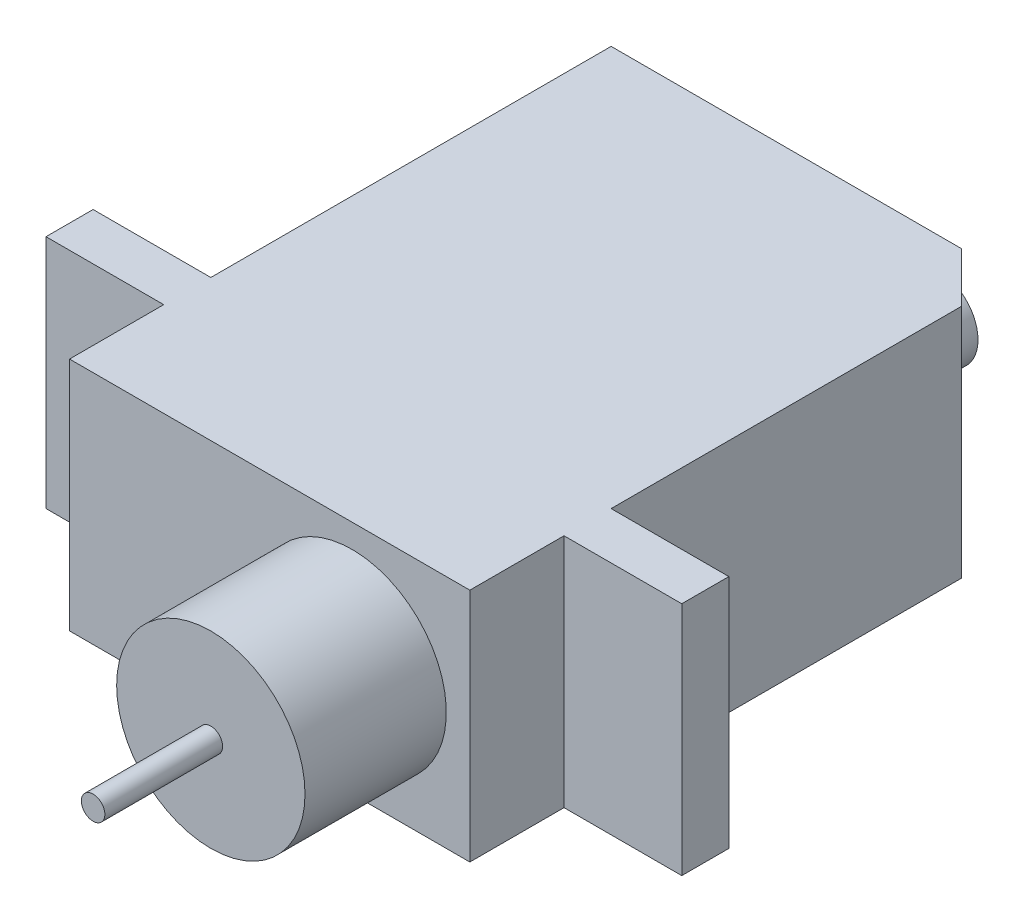
ISO-10303-21;
HEADER;
FILE_DESCRIPTION(('STEP AP214'),'2;1');
FILE_NAME('part.step','',(''),(''),'','','');
FILE_SCHEMA(('AUTOMOTIVE_DESIGN { 1 0 10303 214 1 1 1 1 }'));
ENDSEC;
DATA;
#1=APPLICATION_CONTEXT('core data for automotive mechanical design processes');
#2=APPLICATION_PROTOCOL_DEFINITION('international standard','automotive_design',2000,#1);
#3=PRODUCT_CONTEXT('',#1,'mechanical');
#4=PRODUCT('Part','Part','',(#3));
#5=PRODUCT_RELATED_PRODUCT_CATEGORY('part','',(#4));
#6=PRODUCT_DEFINITION_FORMATION('','',#4);
#7=PRODUCT_DEFINITION_CONTEXT('part definition',#1,'design');
#8=PRODUCT_DEFINITION('design','',#6,#7);
#9=PRODUCT_DEFINITION_SHAPE('','',#8);
#10=(LENGTH_UNIT() NAMED_UNIT(*) SI_UNIT(.MILLI.,.METRE.));
#11=(NAMED_UNIT(*) PLANE_ANGLE_UNIT() SI_UNIT($,.RADIAN.));
#12=(NAMED_UNIT(*) SI_UNIT($,.STERADIAN.) SOLID_ANGLE_UNIT());
#13=UNCERTAINTY_MEASURE_WITH_UNIT(LENGTH_MEASURE(1.E-05),#10,'distance_accuracy_value','');
#14=(GEOMETRIC_REPRESENTATION_CONTEXT(3) GLOBAL_UNCERTAINTY_ASSIGNED_CONTEXT((#13)) GLOBAL_UNIT_ASSIGNED_CONTEXT((#10,
#11,#12)) REPRESENTATION_CONTEXT('',''));
#15=CARTESIAN_POINT('',(0.,0.,0.));
#16=DIRECTION('',(0.,0.,1.));
#17=DIRECTION('',(1.,0.,0.));
#18=AXIS2_PLACEMENT_3D('',#15,#16,#17);
#19=CARTESIAN_POINT('',(0.,10.,17.));
#20=DIRECTION('',(1.,0.,0.));
#21=DIRECTION('',(0.,0.,-1.));
#22=AXIS2_PLACEMENT_3D('',#19,#20,#21);
#23=PLANE('',#22);
#24=DIRECTION('',(0.,0.,1.));
#25=VECTOR('',#24,1.);
#26=CARTESIAN_POINT('',(0.,0.,17.));
#27=LINE('',#26,#25);
#28=CARTESIAN_POINT('',(0.,0.,0.));
#29=VERTEX_POINT('',#28);
#30=CARTESIAN_POINT('',(0.,0.,17.));
#31=VERTEX_POINT('',#30);
#32=EDGE_CURVE('E163',#29,#31,#27,.T.);
#33=ORIENTED_EDGE('',*,*,#32,.T.);
#34=DIRECTION('',(0.,-1.,0.));
#35=VECTOR('',#34,1.);
#36=CARTESIAN_POINT('',(0.,10.,17.));
#37=LINE('',#36,#35);
#38=CARTESIAN_POINT('',(0.,10.,17.));
#39=VERTEX_POINT('',#38);
#40=EDGE_CURVE('E216',#39,#31,#37,.T.);
#41=ORIENTED_EDGE('',*,*,#40,.F.);
#42=DIRECTION('',(0.,0.,1.));
#43=VECTOR('',#42,1.);
#44=CARTESIAN_POINT('',(0.,10.,17.));
#45=LINE('',#44,#43);
#46=CARTESIAN_POINT('',(0.,10.,0.));
#47=VERTEX_POINT('',#46);
#48=EDGE_CURVE('E188',#47,#39,#45,.T.);
#49=ORIENTED_EDGE('',*,*,#48,.F.);
#50=DIRECTION('',(0.,-1.,0.));
#51=VECTOR('',#50,1.);
#52=CARTESIAN_POINT('',(0.,10.,0.));
#53=LINE('',#52,#51);
#54=EDGE_CURVE('E159',#47,#29,#53,.T.);
#55=ORIENTED_EDGE('',*,*,#54,.T.);
#56=EDGE_LOOP('',(#33,#41,#49,#55));
#57=FACE_BOUND('',#56,.T.);
#58=ADVANCED_FACE('F36',(#57),#23,.F.);
#59=CARTESIAN_POINT('',(-5.,10.,17.));
#60=DIRECTION('',(0.,0.,1.));
#61=DIRECTION('',(1.,0.,0.));
#62=AXIS2_PLACEMENT_3D('',#59,#60,#61);
#63=PLANE('',#62);
#64=DIRECTION('',(-1.,0.,0.));
#65=VECTOR('',#64,1.);
#66=CARTESIAN_POINT('',(-5.,0.,17.));
#67=LINE('',#66,#65);
#68=CARTESIAN_POINT('',(-5.,0.,17.));
#69=VERTEX_POINT('',#68);
#70=EDGE_CURVE('E166',#31,#69,#67,.T.);
#71=ORIENTED_EDGE('',*,*,#70,.T.);
#72=DIRECTION('',(0.,-1.,0.));
#73=VECTOR('',#72,1.);
#74=CARTESIAN_POINT('',(-5.,10.,17.));
#75=LINE('',#74,#73);
#76=CARTESIAN_POINT('',(-5.,10.,17.));
#77=VERTEX_POINT('',#76);
#78=EDGE_CURVE('E213',#77,#69,#75,.T.);
#79=ORIENTED_EDGE('',*,*,#78,.F.);
#80=DIRECTION('',(-1.,0.,0.));
#81=VECTOR('',#80,1.);
#82=CARTESIAN_POINT('',(-5.,10.,17.));
#83=LINE('',#82,#81);
#84=EDGE_CURVE('E111',#39,#77,#83,.T.);
#85=ORIENTED_EDGE('',*,*,#84,.F.);
#86=ORIENTED_EDGE('',*,*,#40,.T.);
#87=EDGE_LOOP('',(#71,#79,#85,#86));
#88=FACE_BOUND('',#87,.T.);
#89=ADVANCED_FACE('F302',(#88),#63,.F.);
#90=CARTESIAN_POINT('',(-5.,10.,19.));
#91=DIRECTION('',(1.,0.,0.));
#92=DIRECTION('',(0.,0.,-1.));
#93=AXIS2_PLACEMENT_3D('',#90,#91,#92);
#94=PLANE('',#93);
#95=DIRECTION('',(0.,0.,1.));
#96=VECTOR('',#95,1.);
#97=CARTESIAN_POINT('',(-5.,0.,19.));
#98=LINE('',#97,#96);
#99=CARTESIAN_POINT('',(-5.,0.,19.));
#100=VERTEX_POINT('',#99);
#101=EDGE_CURVE('E169',#69,#100,#98,.T.);
#102=ORIENTED_EDGE('',*,*,#101,.T.);
#103=DIRECTION('',(0.,-1.,0.));
#104=VECTOR('',#103,1.);
#105=CARTESIAN_POINT('',(-5.,10.,19.));
#106=LINE('',#105,#104);
#107=CARTESIAN_POINT('',(-5.,10.,19.));
#108=VERTEX_POINT('',#107);
#109=EDGE_CURVE('E210',#108,#100,#106,.T.);
#110=ORIENTED_EDGE('',*,*,#109,.F.);
#111=DIRECTION('',(0.,0.,1.));
#112=VECTOR('',#111,1.);
#113=CARTESIAN_POINT('',(-5.,10.,19.));
#114=LINE('',#113,#112);
#115=EDGE_CURVE('E264',#77,#108,#114,.T.);
#116=ORIENTED_EDGE('',*,*,#115,.F.);
#117=ORIENTED_EDGE('',*,*,#78,.T.);
#118=EDGE_LOOP('',(#102,#110,#116,#117));
#119=FACE_BOUND('',#118,.T.);
#120=ADVANCED_FACE('F307',(#119),#94,.F.);
#121=CARTESIAN_POINT('',(0.,10.,19.));
#122=DIRECTION('',(0.,0.,-1.));
#123=DIRECTION('',(-1.,0.,0.));
#124=AXIS2_PLACEMENT_3D('',#121,#122,#123);
#125=PLANE('',#124);
#126=DIRECTION('',(1.,0.,0.));
#127=VECTOR('',#126,1.);
#128=CARTESIAN_POINT('',(0.,0.,19.));
#129=LINE('',#128,#127);
#130=CARTESIAN_POINT('',(0.,0.,19.));
#131=VERTEX_POINT('',#130);
#132=EDGE_CURVE('E171',#100,#131,#129,.T.);
#133=ORIENTED_EDGE('',*,*,#132,.T.);
#134=DIRECTION('',(0.,-1.,0.));
#135=VECTOR('',#134,1.);
#136=CARTESIAN_POINT('',(0.,10.,19.));
#137=LINE('',#136,#135);
#138=CARTESIAN_POINT('',(0.,10.,19.));
#139=VERTEX_POINT('',#138);
#140=EDGE_CURVE('E207',#139,#131,#137,.T.);
#141=ORIENTED_EDGE('',*,*,#140,.F.);
#142=DIRECTION('',(1.,0.,0.));
#143=VECTOR('',#142,1.);
#144=CARTESIAN_POINT('',(0.,10.,19.));
#145=LINE('',#144,#143);
#146=EDGE_CURVE('E262',#108,#139,#145,.T.);
#147=ORIENTED_EDGE('',*,*,#146,.F.);
#148=ORIENTED_EDGE('',*,*,#109,.T.);
#149=EDGE_LOOP('',(#133,#141,#147,#148));
#150=FACE_BOUND('',#149,.T.);
#151=ADVANCED_FACE('F319',(#150),#125,.F.);
#152=CARTESIAN_POINT('',(0.,10.,23.));
#153=DIRECTION('',(1.,0.,0.));
#154=DIRECTION('',(0.,0.,-1.));
#155=AXIS2_PLACEMENT_3D('',#152,#153,#154);
#156=PLANE('',#155);
#157=DIRECTION('',(0.,0.,1.));
#158=VECTOR('',#157,1.);
#159=CARTESIAN_POINT('',(0.,0.,23.));
#160=LINE('',#159,#158);
#161=CARTESIAN_POINT('',(0.,0.,23.));
#162=VERTEX_POINT('',#161);
#163=EDGE_CURVE('E173',#131,#162,#160,.T.);
#164=ORIENTED_EDGE('',*,*,#163,.T.);
#165=DIRECTION('',(0.,-1.,0.));
#166=VECTOR('',#165,1.);
#167=CARTESIAN_POINT('',(0.,10.,23.));
#168=LINE('',#167,#166);
#169=CARTESIAN_POINT('',(0.,10.,23.));
#170=VERTEX_POINT('',#169);
#171=EDGE_CURVE('E204',#170,#162,#168,.T.);
#172=ORIENTED_EDGE('',*,*,#171,.F.);
#173=DIRECTION('',(0.,0.,1.));
#174=VECTOR('',#173,1.);
#175=CARTESIAN_POINT('',(0.,10.,23.));
#176=LINE('',#175,#174);
#177=EDGE_CURVE('E260',#139,#170,#176,.T.);
#178=ORIENTED_EDGE('',*,*,#177,.F.);
#179=ORIENTED_EDGE('',*,*,#140,.T.);
#180=EDGE_LOOP('',(#164,#172,#178,#179));
#181=FACE_BOUND('',#180,.T.);
#182=ADVANCED_FACE('F226',(#181),#156,.F.);
#183=CARTESIAN_POINT('',(17.,10.,23.));
#184=DIRECTION('',(0.,0.,-1.));
#185=DIRECTION('',(-1.,0.,0.));
#186=AXIS2_PLACEMENT_3D('',#183,#184,#185);
#187=PLANE('',#186);
#188=CARTESIAN_POINT('',(12.,5.,23.));
#189=DIRECTION('',(0.,0.,-1.));
#190=DIRECTION('',(-1.,0.,0.));
#191=AXIS2_PLACEMENT_3D('',#188,#189,#190);
#192=CIRCLE('',#191,4.);
#193=CARTESIAN_POINT('',(8.00000000000001,5.,23.));
#194=VERTEX_POINT('',#193);
#195=EDGE_CURVE('E44',#194,#194,#192,.F.);
#196=ORIENTED_EDGE('',*,*,#195,.F.);
#197=EDGE_LOOP('',(#196));
#198=FACE_BOUND('',#197,.T.);
#199=DIRECTION('',(1.,0.,0.));
#200=VECTOR('',#199,1.);
#201=CARTESIAN_POINT('',(17.,0.,23.));
#202=LINE('',#201,#200);
#203=CARTESIAN_POINT('',(17.,0.,23.));
#204=VERTEX_POINT('',#203);
#205=EDGE_CURVE('E175',#162,#204,#202,.T.);
#206=ORIENTED_EDGE('',*,*,#205,.T.);
#207=DIRECTION('',(0.,-1.,0.));
#208=VECTOR('',#207,1.);
#209=CARTESIAN_POINT('',(17.,10.,23.));
#210=LINE('',#209,#208);
#211=CARTESIAN_POINT('',(17.,10.,23.));
#212=VERTEX_POINT('',#211);
#213=EDGE_CURVE('E201',#212,#204,#210,.T.);
#214=ORIENTED_EDGE('',*,*,#213,.F.);
#215=DIRECTION('',(1.,0.,0.));
#216=VECTOR('',#215,1.);
#217=CARTESIAN_POINT('',(17.,10.,23.));
#218=LINE('',#217,#216);
#219=EDGE_CURVE('E258',#170,#212,#218,.T.);
#220=ORIENTED_EDGE('',*,*,#219,.F.);
#221=ORIENTED_EDGE('',*,*,#171,.T.);
#222=EDGE_LOOP('',(#206,#214,#220,#221));
#223=FACE_BOUND('',#222,.T.);
#224=ADVANCED_FACE('F222',(#198,#223),#187,.F.);
#225=CARTESIAN_POINT('',(17.,10.,19.));
#226=DIRECTION('',(-1.,0.,0.));
#227=DIRECTION('',(0.,0.,1.));
#228=AXIS2_PLACEMENT_3D('',#225,#226,#227);
#229=PLANE('',#228);
#230=DIRECTION('',(0.,0.,-1.));
#231=VECTOR('',#230,1.);
#232=CARTESIAN_POINT('',(17.,0.,19.));
#233=LINE('',#232,#231);
#234=CARTESIAN_POINT('',(17.,0.,19.));
#235=VERTEX_POINT('',#234);
#236=EDGE_CURVE('E177',#204,#235,#233,.T.);
#237=ORIENTED_EDGE('',*,*,#236,.T.);
#238=DIRECTION('',(0.,-1.,0.));
#239=VECTOR('',#238,1.);
#240=CARTESIAN_POINT('',(17.,10.,19.));
#241=LINE('',#240,#239);
#242=CARTESIAN_POINT('',(17.,10.,19.));
#243=VERTEX_POINT('',#242);
#244=EDGE_CURVE('E198',#243,#235,#241,.T.);
#245=ORIENTED_EDGE('',*,*,#244,.F.);
#246=DIRECTION('',(0.,0.,-1.));
#247=VECTOR('',#246,1.);
#248=CARTESIAN_POINT('',(17.,10.,19.));
#249=LINE('',#248,#247);
#250=EDGE_CURVE('E238',#212,#243,#249,.T.);
#251=ORIENTED_EDGE('',*,*,#250,.F.);
#252=ORIENTED_EDGE('',*,*,#213,.T.);
#253=EDGE_LOOP('',(#237,#245,#251,#252));
#254=FACE_BOUND('',#253,.T.);
#255=ADVANCED_FACE('F225',(#254),#229,.F.);
#256=CARTESIAN_POINT('',(22.,10.,19.));
#257=DIRECTION('',(0.,0.,-1.));
#258=DIRECTION('',(-1.,0.,0.));
#259=AXIS2_PLACEMENT_3D('',#256,#257,#258);
#260=PLANE('',#259);
#261=DIRECTION('',(1.,0.,0.));
#262=VECTOR('',#261,1.);
#263=CARTESIAN_POINT('',(22.,0.,19.));
#264=LINE('',#263,#262);
#265=CARTESIAN_POINT('',(22.,0.,19.));
#266=VERTEX_POINT('',#265);
#267=EDGE_CURVE('E179',#235,#266,#264,.T.);
#268=ORIENTED_EDGE('',*,*,#267,.T.);
#269=DIRECTION('',(0.,-1.,0.));
#270=VECTOR('',#269,1.);
#271=CARTESIAN_POINT('',(22.,10.,19.));
#272=LINE('',#271,#270);
#273=CARTESIAN_POINT('',(22.,10.,19.));
#274=VERTEX_POINT('',#273);
#275=EDGE_CURVE('E195',#274,#266,#272,.T.);
#276=ORIENTED_EDGE('',*,*,#275,.F.);
#277=DIRECTION('',(1.,0.,0.));
#278=VECTOR('',#277,1.);
#279=CARTESIAN_POINT('',(22.,10.,19.));
#280=LINE('',#279,#278);
#281=EDGE_CURVE('E253',#243,#274,#280,.T.);
#282=ORIENTED_EDGE('',*,*,#281,.F.);
#283=ORIENTED_EDGE('',*,*,#244,.T.);
#284=EDGE_LOOP('',(#268,#276,#282,#283));
#285=FACE_BOUND('',#284,.T.);
#286=ADVANCED_FACE('F246',(#285),#260,.F.);
#287=CARTESIAN_POINT('',(22.,10.,17.));
#288=DIRECTION('',(-1.,0.,0.));
#289=DIRECTION('',(0.,0.,1.));
#290=AXIS2_PLACEMENT_3D('',#287,#288,#289);
#291=PLANE('',#290);
#292=DIRECTION('',(0.,0.,-1.));
#293=VECTOR('',#292,1.);
#294=CARTESIAN_POINT('',(22.,0.,17.));
#295=LINE('',#294,#293);
#296=CARTESIAN_POINT('',(22.,0.,17.));
#297=VERTEX_POINT('',#296);
#298=EDGE_CURVE('E181',#266,#297,#295,.T.);
#299=ORIENTED_EDGE('',*,*,#298,.T.);
#300=DIRECTION('',(0.,-1.,0.));
#301=VECTOR('',#300,1.);
#302=CARTESIAN_POINT('',(22.,10.,17.));
#303=LINE('',#302,#301);
#304=CARTESIAN_POINT('',(22.,10.,17.));
#305=VERTEX_POINT('',#304);
#306=EDGE_CURVE('E192',#305,#297,#303,.T.);
#307=ORIENTED_EDGE('',*,*,#306,.F.);
#308=DIRECTION('',(0.,0.,-1.));
#309=VECTOR('',#308,1.);
#310=CARTESIAN_POINT('',(22.,10.,17.));
#311=LINE('',#310,#309);
#312=EDGE_CURVE('E252',#274,#305,#311,.T.);
#313=ORIENTED_EDGE('',*,*,#312,.F.);
#314=ORIENTED_EDGE('',*,*,#275,.T.);
#315=EDGE_LOOP('',(#299,#307,#313,#314));
#316=FACE_BOUND('',#315,.T.);
#317=ADVANCED_FACE('F250',(#316),#291,.F.);
#318=CARTESIAN_POINT('',(17.,10.,17.));
#319=DIRECTION('',(0.,0.,1.));
#320=DIRECTION('',(1.,0.,0.));
#321=AXIS2_PLACEMENT_3D('',#318,#319,#320);
#322=PLANE('',#321);
#323=DIRECTION('',(-1.,0.,0.));
#324=VECTOR('',#323,1.);
#325=CARTESIAN_POINT('',(17.,0.,17.));
#326=LINE('',#325,#324);
#327=CARTESIAN_POINT('',(17.,0.,17.));
#328=VERTEX_POINT('',#327);
#329=EDGE_CURVE('E183',#297,#328,#326,.T.);
#330=ORIENTED_EDGE('',*,*,#329,.T.);
#331=DIRECTION('',(0.,-1.,0.));
#332=VECTOR('',#331,1.);
#333=CARTESIAN_POINT('',(17.,10.,17.));
#334=LINE('',#333,#332);
#335=CARTESIAN_POINT('',(17.,10.,17.));
#336=VERTEX_POINT('',#335);
#337=EDGE_CURVE('E154',#336,#328,#334,.T.);
#338=ORIENTED_EDGE('',*,*,#337,.F.);
#339=DIRECTION('',(-1.,0.,0.));
#340=VECTOR('',#339,1.);
#341=CARTESIAN_POINT('',(17.,10.,17.));
#342=LINE('',#341,#340);
#343=EDGE_CURVE('E145',#305,#336,#342,.T.);
#344=ORIENTED_EDGE('',*,*,#343,.F.);
#345=ORIENTED_EDGE('',*,*,#306,.T.);
#346=EDGE_LOOP('',(#330,#338,#344,#345));
#347=FACE_BOUND('',#346,.T.);
#348=ADVANCED_FACE('F371',(#347),#322,.F.);
#349=CARTESIAN_POINT('',(17.,10.,2.12132034355961));
#350=DIRECTION('',(-1.,0.,0.));
#351=DIRECTION('',(0.,0.,1.));
#352=AXIS2_PLACEMENT_3D('',#349,#350,#351);
#353=PLANE('',#352);
#354=DIRECTION('',(0.,0.,-1.));
#355=VECTOR('',#354,1.);
#356=CARTESIAN_POINT('',(17.,0.,2.12132034355961));
#357=LINE('',#356,#355);
#358=CARTESIAN_POINT('',(17.,0.,2.12132034355961));
#359=VERTEX_POINT('',#358);
#360=EDGE_CURVE('E153',#328,#359,#357,.T.);
#361=ORIENTED_EDGE('',*,*,#360,.T.);
#362=DIRECTION('',(0.,-1.,0.));
#363=VECTOR('',#362,1.);
#364=CARTESIAN_POINT('',(17.,10.,2.12132034355961));
#365=LINE('',#364,#363);
#366=CARTESIAN_POINT('',(17.,10.,2.12132034355961));
#367=VERTEX_POINT('',#366);
#368=EDGE_CURVE('E150',#367,#359,#365,.T.);
#369=ORIENTED_EDGE('',*,*,#368,.F.);
#370=DIRECTION('',(0.,0.,-1.));
#371=VECTOR('',#370,1.);
#372=CARTESIAN_POINT('',(17.,10.,2.12132034355961));
#373=LINE('',#372,#371);
#374=EDGE_CURVE('E139',#336,#367,#373,.T.);
#375=ORIENTED_EDGE('',*,*,#374,.F.);
#376=ORIENTED_EDGE('',*,*,#337,.T.);
#377=EDGE_LOOP('',(#361,#369,#375,#376));
#378=FACE_BOUND('',#377,.T.);
#379=ADVANCED_FACE('F151',(#378),#353,.F.);
#380=CARTESIAN_POINT('',(14.8786796564403,10.,0.));
#381=DIRECTION('',(-0.707106781186538,0.,0.707106781186557));
#382=DIRECTION('',(0.707106781186557,0.,0.707106781186538));
#383=AXIS2_PLACEMENT_3D('',#380,#381,#382);
#384=PLANE('',#383);
#385=DIRECTION('',(-0.707106781186557,0.,-0.707106781186538));
#386=VECTOR('',#385,1.);
#387=CARTESIAN_POINT('',(14.8786796564403,0.,0.));
#388=LINE('',#387,#386);
#389=CARTESIAN_POINT('',(14.8786796564403,0.,0.));
#390=VERTEX_POINT('',#389);
#391=EDGE_CURVE('E96',#359,#390,#388,.T.);
#392=ORIENTED_EDGE('',*,*,#391,.T.);
#393=DIRECTION('',(0.,-1.,0.));
#394=VECTOR('',#393,1.);
#395=CARTESIAN_POINT('',(14.8786796564403,10.,0.));
#396=LINE('',#395,#394);
#397=CARTESIAN_POINT('',(14.8786796564403,10.,0.));
#398=VERTEX_POINT('',#397);
#399=EDGE_CURVE('E155',#398,#390,#396,.T.);
#400=ORIENTED_EDGE('',*,*,#399,.F.);
#401=DIRECTION('',(-0.707106781186557,0.,-0.707106781186538));
#402=VECTOR('',#401,1.);
#403=CARTESIAN_POINT('',(14.8786796564403,10.,0.));
#404=LINE('',#403,#402);
#405=EDGE_CURVE('E143',#367,#398,#404,.T.);
#406=ORIENTED_EDGE('',*,*,#405,.F.);
#407=ORIENTED_EDGE('',*,*,#368,.T.);
#408=EDGE_LOOP('',(#392,#400,#406,#407));
#409=FACE_BOUND('',#408,.T.);
#410=ADVANCED_FACE('F157',(#409),#384,.F.);
#411=CARTESIAN_POINT('',(0.,10.,0.));
#412=DIRECTION('',(0.,0.,1.));
#413=DIRECTION('',(1.,0.,0.));
#414=AXIS2_PLACEMENT_3D('',#411,#412,#413);
#415=PLANE('',#414);
#416=CARTESIAN_POINT('',(11.8786796564403,5.,0.));
#417=DIRECTION('',(0.,0.,1.));
#418=DIRECTION('',(1.,0.,0.));
#419=AXIS2_PLACEMENT_3D('',#416,#417,#418);
#420=CIRCLE('',#419,1.70188186902318);
#421=CARTESIAN_POINT('',(13.5805615254635,5.,0.));
#422=VERTEX_POINT('',#421);
#423=EDGE_CURVE('E11',#422,#422,#420,.F.);
#424=ORIENTED_EDGE('',*,*,#423,.F.);
#425=EDGE_LOOP('',(#424));
#426=FACE_BOUND('',#425,.T.);
#427=DIRECTION('',(-1.,0.,0.));
#428=VECTOR('',#427,1.);
#429=CARTESIAN_POINT('',(0.,0.,0.));
#430=LINE('',#429,#428);
#431=EDGE_CURVE('E102',#390,#29,#430,.T.);
#432=ORIENTED_EDGE('',*,*,#431,.T.);
#433=ORIENTED_EDGE('',*,*,#54,.F.);
#434=DIRECTION('',(-1.,0.,0.));
#435=VECTOR('',#434,1.);
#436=CARTESIAN_POINT('',(0.,10.,0.));
#437=LINE('',#436,#435);
#438=EDGE_CURVE('E52',#398,#47,#437,.T.);
#439=ORIENTED_EDGE('',*,*,#438,.F.);
#440=ORIENTED_EDGE('',*,*,#399,.T.);
#441=EDGE_LOOP('',(#432,#433,#439,#440));
#442=FACE_BOUND('',#441,.T.);
#443=ADVANCED_FACE('F289',(#426,#442),#415,.F.);
#444=CARTESIAN_POINT('',(0.,10.,0.));
#445=DIRECTION('',(0.,-1.,0.));
#446=DIRECTION('',(0.,0.,-1.));
#447=AXIS2_PLACEMENT_3D('',#444,#445,#446);
#448=PLANE('',#447);
#449=ORIENTED_EDGE('',*,*,#48,.T.);
#450=ORIENTED_EDGE('',*,*,#84,.T.);
#451=ORIENTED_EDGE('',*,*,#115,.T.);
#452=ORIENTED_EDGE('',*,*,#146,.T.);
#453=ORIENTED_EDGE('',*,*,#177,.T.);
#454=ORIENTED_EDGE('',*,*,#219,.T.);
#455=ORIENTED_EDGE('',*,*,#250,.T.);
#456=ORIENTED_EDGE('',*,*,#281,.T.);
#457=ORIENTED_EDGE('',*,*,#312,.T.);
#458=ORIENTED_EDGE('',*,*,#343,.T.);
#459=ORIENTED_EDGE('',*,*,#374,.T.);
#460=ORIENTED_EDGE('',*,*,#405,.T.);
#461=ORIENTED_EDGE('',*,*,#438,.T.);
#462=EDGE_LOOP('',(#449,#450,#451,#452,#453,#454,#455,#456,#457,#458,#459,#460,#461));
#463=FACE_BOUND('',#462,.T.);
#464=ADVANCED_FACE('F141',(#463),#448,.F.);
#465=CARTESIAN_POINT('',(0.,0.,0.));
#466=DIRECTION('',(0.,-1.,0.));
#467=DIRECTION('',(0.,0.,-1.));
#468=AXIS2_PLACEMENT_3D('',#465,#466,#467);
#469=PLANE('',#468);
#470=ORIENTED_EDGE('',*,*,#32,.F.);
#471=ORIENTED_EDGE('',*,*,#431,.F.);
#472=ORIENTED_EDGE('',*,*,#391,.F.);
#473=ORIENTED_EDGE('',*,*,#360,.F.);
#474=ORIENTED_EDGE('',*,*,#329,.F.);
#475=ORIENTED_EDGE('',*,*,#298,.F.);
#476=ORIENTED_EDGE('',*,*,#267,.F.);
#477=ORIENTED_EDGE('',*,*,#236,.F.);
#478=ORIENTED_EDGE('',*,*,#205,.F.);
#479=ORIENTED_EDGE('',*,*,#163,.F.);
#480=ORIENTED_EDGE('',*,*,#132,.F.);
#481=ORIENTED_EDGE('',*,*,#101,.F.);
#482=ORIENTED_EDGE('',*,*,#70,.F.);
#483=EDGE_LOOP('',(#470,#471,#472,#473,#474,#475,#476,#477,#478,#479,#480,#481,#482));
#484=FACE_BOUND('',#483,.T.);
#485=ADVANCED_FACE('F241',(#484),#469,.T.);
#486=CARTESIAN_POINT('',(12.,5.,29.));
#487=DIRECTION('',(0.,0.,-1.));
#488=DIRECTION('',(-1.,0.,0.));
#489=AXIS2_PLACEMENT_3D('',#486,#487,#488);
#490=CYLINDRICAL_SURFACE('',#489,4.);
#491=CARTESIAN_POINT('',(12.,5.,29.));
#492=DIRECTION('',(0.,0.,1.));
#493=DIRECTION('',(1.,0.,0.));
#494=AXIS2_PLACEMENT_3D('',#491,#492,#493);
#495=CIRCLE('',#494,4.);
#496=CARTESIAN_POINT('',(16.,5.,29.));
#497=VERTEX_POINT('',#496);
#498=EDGE_CURVE('E167',#497,#497,#495,.T.);
#499=ORIENTED_EDGE('',*,*,#498,.F.);
#500=EDGE_LOOP('',(#499));
#501=FACE_BOUND('',#500,.T.);
#502=ORIENTED_EDGE('',*,*,#195,.T.);
#503=EDGE_LOOP('',(#502));
#504=FACE_BOUND('',#503,.T.);
#505=ADVANCED_FACE('F220',(#501,#504),#490,.T.);
#506=CARTESIAN_POINT('',(12.,5.,29.));
#507=DIRECTION('',(0.,0.,1.));
#508=DIRECTION('',(1.,0.,0.));
#509=AXIS2_PLACEMENT_3D('',#506,#507,#508);
#510=PLANE('',#509);
#511=CARTESIAN_POINT('',(12.,5.,29.));
#512=DIRECTION('',(0.,0.,1.));
#513=DIRECTION('',(1.,0.,0.));
#514=AXIS2_PLACEMENT_3D('',#511,#512,#513);
#515=CIRCLE('',#514,0.500000000000001);
#516=CARTESIAN_POINT('',(12.5,5.,29.));
#517=VERTEX_POINT('',#516);
#518=EDGE_CURVE('E271',#517,#517,#515,.T.);
#519=ORIENTED_EDGE('',*,*,#518,.F.);
#520=EDGE_LOOP('',(#519));
#521=FACE_BOUND('',#520,.T.);
#522=ORIENTED_EDGE('',*,*,#498,.T.);
#523=EDGE_LOOP('',(#522));
#524=FACE_BOUND('',#523,.T.);
#525=ADVANCED_FACE('F429',(#521,#524),#510,.T.);
#526=CARTESIAN_POINT('',(12.,5.,34.));
#527=DIRECTION('',(0.,0.,-1.));
#528=DIRECTION('',(-1.,0.,0.));
#529=AXIS2_PLACEMENT_3D('',#526,#527,#528);
#530=CYLINDRICAL_SURFACE('',#529,0.500000000000001);
#531=CARTESIAN_POINT('',(12.,5.,34.));
#532=DIRECTION('',(0.,0.,1.));
#533=DIRECTION('',(1.,0.,0.));
#534=AXIS2_PLACEMENT_3D('',#531,#532,#533);
#535=CIRCLE('',#534,0.500000000000001);
#536=CARTESIAN_POINT('',(12.5,5.,34.));
#537=VERTEX_POINT('',#536);
#538=EDGE_CURVE('E270',#537,#537,#535,.T.);
#539=ORIENTED_EDGE('',*,*,#538,.F.);
#540=EDGE_LOOP('',(#539));
#541=FACE_BOUND('',#540,.T.);
#542=ORIENTED_EDGE('',*,*,#518,.T.);
#543=EDGE_LOOP('',(#542));
#544=FACE_BOUND('',#543,.T.);
#545=ADVANCED_FACE('F440',(#541,#544),#530,.T.);
#546=CARTESIAN_POINT('',(12.,5.,34.));
#547=DIRECTION('',(0.,0.,1.));
#548=DIRECTION('',(1.,0.,0.));
#549=AXIS2_PLACEMENT_3D('',#546,#547,#548);
#550=PLANE('',#549);
#551=ORIENTED_EDGE('',*,*,#538,.T.);
#552=EDGE_LOOP('',(#551));
#553=FACE_BOUND('',#552,.T.);
#554=ADVANCED_FACE('F285',(#553),#550,.T.);
#555=CARTESIAN_POINT('',(11.8786796564403,5.,-2.));
#556=DIRECTION('',(0.,0.,1.));
#557=DIRECTION('',(1.,0.,0.));
#558=AXIS2_PLACEMENT_3D('',#555,#556,#557);
#559=CYLINDRICAL_SURFACE('',#558,1.70188186902318);
#560=CARTESIAN_POINT('',(11.8786796564403,5.,-2.));
#561=DIRECTION('',(0.,0.,-1.));
#562=DIRECTION('',(-1.,0.,0.));
#563=AXIS2_PLACEMENT_3D('',#560,#561,#562);
#564=CIRCLE('',#563,1.70188186902318);
#565=CARTESIAN_POINT('',(10.1767977874172,5.,-2.));
#566=VERTEX_POINT('',#565);
#567=EDGE_CURVE('E274',#566,#566,#564,.T.);
#568=ORIENTED_EDGE('',*,*,#567,.F.);
#569=EDGE_LOOP('',(#568));
#570=FACE_BOUND('',#569,.T.);
#571=ORIENTED_EDGE('',*,*,#423,.T.);
#572=EDGE_LOOP('',(#571));
#573=FACE_BOUND('',#572,.T.);
#574=ADVANCED_FACE('F282',(#570,#573),#559,.T.);
#575=CARTESIAN_POINT('',(11.8786796564403,5.,-2.));
#576=DIRECTION('',(0.,0.,-1.));
#577=DIRECTION('',(-1.,0.,0.));
#578=AXIS2_PLACEMENT_3D('',#575,#576,#577);
#579=PLANE('',#578);
#580=ORIENTED_EDGE('',*,*,#567,.T.);
#581=EDGE_LOOP('',(#580));
#582=FACE_BOUND('',#581,.T.);
#583=ADVANCED_FACE('F280',(#582),#579,.T.);
#584=CLOSED_SHELL('',(#58,#89,#120,#151,#182,#224,#255,#286,#317,#348,#379,#410,#443,#464,#485,
#505,#525,#545,#554,#574,#583));
#585=MANIFOLD_SOLID_BREP('B2',#584);
#586=ADVANCED_BREP_SHAPE_REPRESENTATION('',(#18,#585),#14);
#587=SHAPE_DEFINITION_REPRESENTATION(#9,#586);
ENDSEC;
END-ISO-10303-21;
